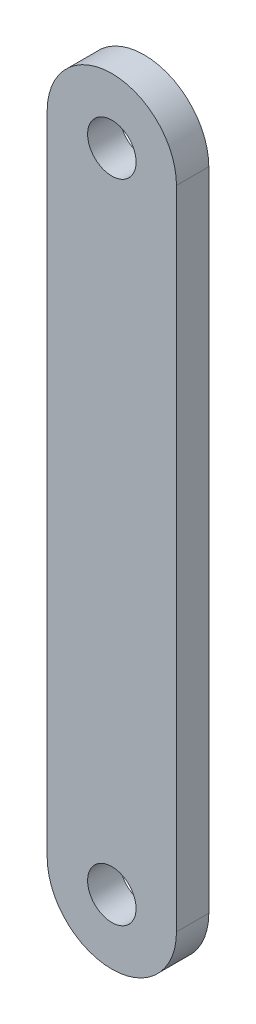
ISO-10303-21;
HEADER;
FILE_DESCRIPTION(('STEP AP214'),'2;1');
FILE_NAME('part.step','',(''),(''),'','','');
FILE_SCHEMA(('AUTOMOTIVE_DESIGN { 1 0 10303 214 1 1 1 1 }'));
ENDSEC;
DATA;
#1=APPLICATION_CONTEXT('core data for automotive mechanical design processes');
#2=APPLICATION_PROTOCOL_DEFINITION('international standard','automotive_design',2000,#1);
#3=PRODUCT_CONTEXT('',#1,'mechanical');
#4=PRODUCT('Part','Part','',(#3));
#5=PRODUCT_RELATED_PRODUCT_CATEGORY('part','',(#4));
#6=PRODUCT_DEFINITION_FORMATION('','',#4);
#7=PRODUCT_DEFINITION_CONTEXT('part definition',#1,'design');
#8=PRODUCT_DEFINITION('design','',#6,#7);
#9=PRODUCT_DEFINITION_SHAPE('','',#8);
#10=(LENGTH_UNIT() NAMED_UNIT(*) SI_UNIT(.MILLI.,.METRE.));
#11=(NAMED_UNIT(*) PLANE_ANGLE_UNIT() SI_UNIT($,.RADIAN.));
#12=(NAMED_UNIT(*) SI_UNIT($,.STERADIAN.) SOLID_ANGLE_UNIT());
#13=UNCERTAINTY_MEASURE_WITH_UNIT(LENGTH_MEASURE(1.E-05),#10,'distance_accuracy_value','');
#14=(GEOMETRIC_REPRESENTATION_CONTEXT(3) GLOBAL_UNCERTAINTY_ASSIGNED_CONTEXT((#13)) GLOBAL_UNIT_ASSIGNED_CONTEXT((#10,
#11,#12)) REPRESENTATION_CONTEXT('',''));
#15=CARTESIAN_POINT('',(0.,0.,0.));
#16=DIRECTION('',(0.,0.,1.));
#17=DIRECTION('',(1.,0.,0.));
#18=AXIS2_PLACEMENT_3D('',#15,#16,#17);
#19=CARTESIAN_POINT('',(0.,-15.5,2.));
#20=DIRECTION('',(0.,0.,1.));
#21=DIRECTION('',(1.,0.,0.));
#22=AXIS2_PLACEMENT_3D('',#19,#20,#21);
#23=PLANE('',#22);
#24=CARTESIAN_POINT('',(0.,24.5,2.));
#25=DIRECTION('',(0.,0.,1.));
#26=DIRECTION('',(1.,0.,0.));
#27=AXIS2_PLACEMENT_3D('',#24,#25,#26);
#28=CIRCLE('',#27,1.5);
#29=CARTESIAN_POINT('',(1.5,24.5,2.));
#30=VERTEX_POINT('',#29);
#31=EDGE_CURVE('E101',#30,#30,#28,.T.);
#32=ORIENTED_EDGE('',*,*,#31,.F.);
#33=EDGE_LOOP('',(#32));
#34=FACE_BOUND('',#33,.T.);
#35=CARTESIAN_POINT('',(0.,-15.5,2.));
#36=DIRECTION('',(0.,0.,1.));
#37=DIRECTION('',(1.,0.,0.));
#38=AXIS2_PLACEMENT_3D('',#35,#36,#37);
#39=CIRCLE('',#38,4.);
#40=CARTESIAN_POINT('',(-3.99999999999999,-15.5,2.));
#41=VERTEX_POINT('',#40);
#42=CARTESIAN_POINT('',(4.00000000000001,-15.5,2.));
#43=VERTEX_POINT('',#42);
#44=EDGE_CURVE('E86',#41,#43,#39,.T.);
#45=ORIENTED_EDGE('',*,*,#44,.T.);
#46=DIRECTION('',(0.,1.,0.));
#47=VECTOR('',#46,1.);
#48=CARTESIAN_POINT('',(4.,24.5,2.));
#49=LINE('',#48,#47);
#50=CARTESIAN_POINT('',(4.,24.5,2.));
#51=VERTEX_POINT('',#50);
#52=EDGE_CURVE('E81',#43,#51,#49,.T.);
#53=ORIENTED_EDGE('',*,*,#52,.T.);
#54=CARTESIAN_POINT('',(0.,24.5,2.));
#55=DIRECTION('',(0.,0.,1.));
#56=DIRECTION('',(1.,0.,0.));
#57=AXIS2_PLACEMENT_3D('',#54,#55,#56);
#58=CIRCLE('',#57,4.);
#59=CARTESIAN_POINT('',(-4.,24.5,2.));
#60=VERTEX_POINT('',#59);
#61=EDGE_CURVE('E84',#51,#60,#58,.T.);
#62=ORIENTED_EDGE('',*,*,#61,.T.);
#63=DIRECTION('',(0.,-1.,0.));
#64=VECTOR('',#63,1.);
#65=CARTESIAN_POINT('',(-4.,24.5,2.));
#66=LINE('',#65,#64);
#67=EDGE_CURVE('E51',#60,#41,#66,.T.);
#68=ORIENTED_EDGE('',*,*,#67,.T.);
#69=EDGE_LOOP('',(#45,#53,#62,#68));
#70=FACE_BOUND('',#69,.T.);
#71=CARTESIAN_POINT('',(0.,-15.5,2.));
#72=DIRECTION('',(0.,0.,1.));
#73=DIRECTION('',(1.,0.,0.));
#74=AXIS2_PLACEMENT_3D('',#71,#72,#73);
#75=CIRCLE('',#74,1.5);
#76=CARTESIAN_POINT('',(1.50000000000001,-15.5,2.));
#77=VERTEX_POINT('',#76);
#78=EDGE_CURVE('E116',#77,#77,#75,.T.);
#79=ORIENTED_EDGE('',*,*,#78,.F.);
#80=EDGE_LOOP('',(#79));
#81=FACE_BOUND('',#80,.T.);
#82=ADVANCED_FACE('F34',(#34,#70,#81),#23,.T.);
#83=CARTESIAN_POINT('',(0.,-15.5,0.));
#84=DIRECTION('',(0.,0.,1.));
#85=DIRECTION('',(1.,0.,0.));
#86=AXIS2_PLACEMENT_3D('',#83,#84,#85);
#87=PLANE('',#86);
#88=CARTESIAN_POINT('',(0.,24.5,0.));
#89=DIRECTION('',(0.,0.,1.));
#90=DIRECTION('',(1.,0.,0.));
#91=AXIS2_PLACEMENT_3D('',#88,#89,#90);
#92=CIRCLE('',#91,1.5);
#93=CARTESIAN_POINT('',(1.5,24.5,0.));
#94=VERTEX_POINT('',#93);
#95=EDGE_CURVE('E113',#94,#94,#92,.T.);
#96=ORIENTED_EDGE('',*,*,#95,.T.);
#97=EDGE_LOOP('',(#96));
#98=FACE_BOUND('',#97,.T.);
#99=CARTESIAN_POINT('',(0.,-15.5,0.));
#100=DIRECTION('',(0.,0.,1.));
#101=DIRECTION('',(1.,0.,0.));
#102=AXIS2_PLACEMENT_3D('',#99,#100,#101);
#103=CIRCLE('',#102,4.);
#104=CARTESIAN_POINT('',(-3.99999999999999,-15.5,0.));
#105=VERTEX_POINT('',#104);
#106=CARTESIAN_POINT('',(4.00000000000001,-15.5,0.));
#107=VERTEX_POINT('',#106);
#108=EDGE_CURVE('E98',#105,#107,#103,.T.);
#109=ORIENTED_EDGE('',*,*,#108,.F.);
#110=DIRECTION('',(0.,-1.,0.));
#111=VECTOR('',#110,1.);
#112=CARTESIAN_POINT('',(-4.,24.5,0.));
#113=LINE('',#112,#111);
#114=CARTESIAN_POINT('',(-4.,24.5,0.));
#115=VERTEX_POINT('',#114);
#116=EDGE_CURVE('E74',#115,#105,#113,.T.);
#117=ORIENTED_EDGE('',*,*,#116,.F.);
#118=CARTESIAN_POINT('',(0.,24.5,0.));
#119=DIRECTION('',(0.,0.,1.));
#120=DIRECTION('',(1.,0.,0.));
#121=AXIS2_PLACEMENT_3D('',#118,#119,#120);
#122=CIRCLE('',#121,4.);
#123=CARTESIAN_POINT('',(4.,24.5,0.));
#124=VERTEX_POINT('',#123);
#125=EDGE_CURVE('E68',#124,#115,#122,.T.);
#126=ORIENTED_EDGE('',*,*,#125,.F.);
#127=DIRECTION('',(0.,1.,0.));
#128=VECTOR('',#127,1.);
#129=CARTESIAN_POINT('',(4.,24.5,0.));
#130=LINE('',#129,#128);
#131=EDGE_CURVE('E90',#107,#124,#130,.T.);
#132=ORIENTED_EDGE('',*,*,#131,.F.);
#133=EDGE_LOOP('',(#109,#117,#126,#132));
#134=FACE_BOUND('',#133,.T.);
#135=CARTESIAN_POINT('',(0.,-15.5,0.));
#136=DIRECTION('',(0.,0.,1.));
#137=DIRECTION('',(1.,0.,0.));
#138=AXIS2_PLACEMENT_3D('',#135,#136,#137);
#139=CIRCLE('',#138,1.5);
#140=CARTESIAN_POINT('',(1.50000000000001,-15.5,0.));
#141=VERTEX_POINT('',#140);
#142=EDGE_CURVE('E119',#141,#141,#139,.T.);
#143=ORIENTED_EDGE('',*,*,#142,.T.);
#144=EDGE_LOOP('',(#143));
#145=FACE_BOUND('',#144,.T.);
#146=ADVANCED_FACE('F109',(#98,#134,#145),#87,.F.);
#147=CARTESIAN_POINT('',(0.,-15.5,2.));
#148=DIRECTION('',(0.,0.,-1.));
#149=DIRECTION('',(-1.,0.,0.));
#150=AXIS2_PLACEMENT_3D('',#147,#148,#149);
#151=CYLINDRICAL_SURFACE('',#150,4.);
#152=ORIENTED_EDGE('',*,*,#108,.T.);
#153=DIRECTION('',(0.,0.,-1.));
#154=VECTOR('',#153,1.);
#155=CARTESIAN_POINT('',(4.00000000000001,-15.5,2.));
#156=LINE('',#155,#154);
#157=EDGE_CURVE('E11',#43,#107,#156,.T.);
#158=ORIENTED_EDGE('',*,*,#157,.F.);
#159=ORIENTED_EDGE('',*,*,#44,.F.);
#160=DIRECTION('',(0.,0.,-1.));
#161=VECTOR('',#160,1.);
#162=CARTESIAN_POINT('',(-3.99999999999999,-15.5,2.));
#163=LINE('',#162,#161);
#164=EDGE_CURVE('E94',#41,#105,#163,.T.);
#165=ORIENTED_EDGE('',*,*,#164,.T.);
#166=EDGE_LOOP('',(#152,#158,#159,#165));
#167=FACE_BOUND('',#166,.T.);
#168=ADVANCED_FACE('F36',(#167),#151,.T.);
#169=CARTESIAN_POINT('',(4.,24.5,2.));
#170=DIRECTION('',(-1.,0.,0.));
#171=DIRECTION('',(0.,-1.,0.));
#172=AXIS2_PLACEMENT_3D('',#169,#170,#171);
#173=PLANE('',#172);
#174=ORIENTED_EDGE('',*,*,#131,.T.);
#175=DIRECTION('',(0.,0.,-1.));
#176=VECTOR('',#175,1.);
#177=CARTESIAN_POINT('',(4.,24.5,2.));
#178=LINE('',#177,#176);
#179=EDGE_CURVE('E43',#51,#124,#178,.T.);
#180=ORIENTED_EDGE('',*,*,#179,.F.);
#181=ORIENTED_EDGE('',*,*,#52,.F.);
#182=ORIENTED_EDGE('',*,*,#157,.T.);
#183=EDGE_LOOP('',(#174,#180,#181,#182));
#184=FACE_BOUND('',#183,.T.);
#185=ADVANCED_FACE('F89',(#184),#173,.F.);
#186=CARTESIAN_POINT('',(0.,24.5,2.));
#187=DIRECTION('',(0.,0.,-1.));
#188=DIRECTION('',(-1.,0.,0.));
#189=AXIS2_PLACEMENT_3D('',#186,#187,#188);
#190=CYLINDRICAL_SURFACE('',#189,4.);
#191=ORIENTED_EDGE('',*,*,#125,.T.);
#192=DIRECTION('',(0.,0.,-1.));
#193=VECTOR('',#192,1.);
#194=CARTESIAN_POINT('',(-4.,24.5,2.));
#195=LINE('',#194,#193);
#196=EDGE_CURVE('E91',#60,#115,#195,.T.);
#197=ORIENTED_EDGE('',*,*,#196,.F.);
#198=ORIENTED_EDGE('',*,*,#61,.F.);
#199=ORIENTED_EDGE('',*,*,#179,.T.);
#200=EDGE_LOOP('',(#191,#197,#198,#199));
#201=FACE_BOUND('',#200,.T.);
#202=ADVANCED_FACE('F92',(#201),#190,.T.);
#203=CARTESIAN_POINT('',(-4.,24.5,2.));
#204=DIRECTION('',(1.,0.,0.));
#205=DIRECTION('',(0.,1.,0.));
#206=AXIS2_PLACEMENT_3D('',#203,#204,#205);
#207=PLANE('',#206);
#208=ORIENTED_EDGE('',*,*,#116,.T.);
#209=ORIENTED_EDGE('',*,*,#164,.F.);
#210=ORIENTED_EDGE('',*,*,#67,.F.);
#211=ORIENTED_EDGE('',*,*,#196,.T.);
#212=EDGE_LOOP('',(#208,#209,#210,#211));
#213=FACE_BOUND('',#212,.T.);
#214=ADVANCED_FACE('F106',(#213),#207,.F.);
#215=CARTESIAN_POINT('',(0.,24.5,2.));
#216=DIRECTION('',(0.,0.,-1.));
#217=DIRECTION('',(-1.,0.,0.));
#218=AXIS2_PLACEMENT_3D('',#215,#216,#217);
#219=CYLINDRICAL_SURFACE('',#218,1.5);
#220=ORIENTED_EDGE('',*,*,#31,.T.);
#221=EDGE_LOOP('',(#220));
#222=FACE_BOUND('',#221,.T.);
#223=ORIENTED_EDGE('',*,*,#95,.F.);
#224=EDGE_LOOP('',(#223));
#225=FACE_BOUND('',#224,.T.);
#226=ADVANCED_FACE('F137',(#222,#225),#219,.F.);
#227=CARTESIAN_POINT('',(0.,-15.5,2.));
#228=DIRECTION('',(0.,0.,-1.));
#229=DIRECTION('',(-1.,0.,0.));
#230=AXIS2_PLACEMENT_3D('',#227,#228,#229);
#231=CYLINDRICAL_SURFACE('',#230,1.5);
#232=ORIENTED_EDGE('',*,*,#78,.T.);
#233=EDGE_LOOP('',(#232));
#234=FACE_BOUND('',#233,.T.);
#235=ORIENTED_EDGE('',*,*,#142,.F.);
#236=EDGE_LOOP('',(#235));
#237=FACE_BOUND('',#236,.T.);
#238=ADVANCED_FACE('F125',(#234,#237),#231,.F.);
#239=CLOSED_SHELL('',(#82,#146,#168,#185,#202,#214,#226,#238));
#240=MANIFOLD_SOLID_BREP('B2',#239);
#241=ADVANCED_BREP_SHAPE_REPRESENTATION('',(#18,#240),#14);
#242=SHAPE_DEFINITION_REPRESENTATION(#9,#241);
ENDSEC;
END-ISO-10303-21;
